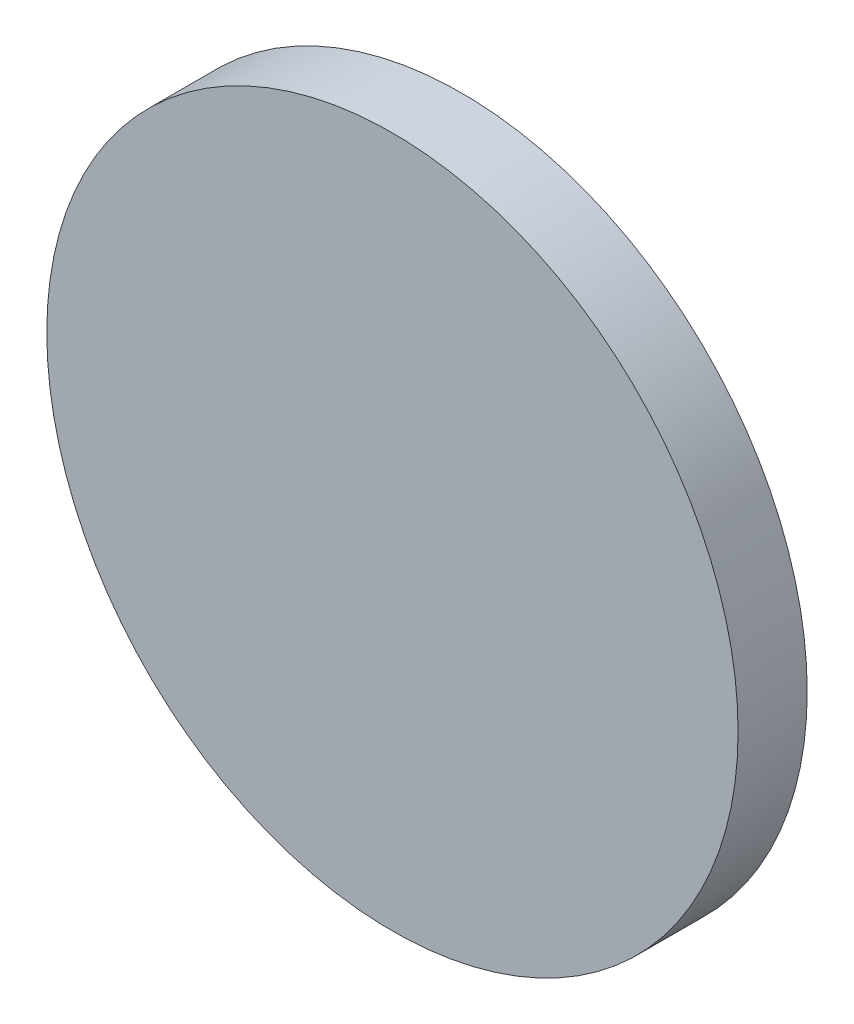
ISO-10303-21;
HEADER;
FILE_DESCRIPTION(('STEP AP214'),'2;1');
FILE_NAME('part.step','',(''),(''),'','','');
FILE_SCHEMA(('AUTOMOTIVE_DESIGN { 1 0 10303 214 1 1 1 1 }'));
ENDSEC;
DATA;
#1=APPLICATION_CONTEXT('core data for automotive mechanical design processes');
#2=APPLICATION_PROTOCOL_DEFINITION('international standard','automotive_design',2000,#1);
#3=PRODUCT_CONTEXT('',#1,'mechanical');
#4=PRODUCT('Part','Part','',(#3));
#5=PRODUCT_RELATED_PRODUCT_CATEGORY('part','',(#4));
#6=PRODUCT_DEFINITION_FORMATION('','',#4);
#7=PRODUCT_DEFINITION_CONTEXT('part definition',#1,'design');
#8=PRODUCT_DEFINITION('design','',#6,#7);
#9=PRODUCT_DEFINITION_SHAPE('','',#8);
#10=(LENGTH_UNIT() NAMED_UNIT(*) SI_UNIT(.MILLI.,.METRE.));
#11=(NAMED_UNIT(*) PLANE_ANGLE_UNIT() SI_UNIT($,.RADIAN.));
#12=(NAMED_UNIT(*) SI_UNIT($,.STERADIAN.) SOLID_ANGLE_UNIT());
#13=UNCERTAINTY_MEASURE_WITH_UNIT(LENGTH_MEASURE(1.E-05),#10,'distance_accuracy_value','');
#14=(GEOMETRIC_REPRESENTATION_CONTEXT(3) GLOBAL_UNCERTAINTY_ASSIGNED_CONTEXT((#13)) GLOBAL_UNIT_ASSIGNED_CONTEXT((#10,
#11,#12)) REPRESENTATION_CONTEXT('',''));
#15=CARTESIAN_POINT('',(0.,0.,0.));
#16=DIRECTION('',(0.,0.,1.));
#17=DIRECTION('',(1.,0.,0.));
#18=AXIS2_PLACEMENT_3D('',#15,#16,#17);
#19=CARTESIAN_POINT('',(-85.,68.,3.));
#20=DIRECTION('',(0.,0.,-1.));
#21=DIRECTION('',(-1.,0.,0.));
#22=AXIS2_PLACEMENT_3D('',#19,#20,#21);
#23=CYLINDRICAL_SURFACE('',#22,15.);
#24=CARTESIAN_POINT('',(-85.,68.,3.));
#25=DIRECTION('',(0.,0.,1.));
#26=DIRECTION('',(1.,0.,0.));
#27=AXIS2_PLACEMENT_3D('',#24,#25,#26);
#28=CIRCLE('',#27,15.);
#29=CARTESIAN_POINT('',(-69.9999999999999,68.,3.));
#30=VERTEX_POINT('',#29);
#31=EDGE_CURVE('E10',#30,#30,#28,.T.);
#32=ORIENTED_EDGE('',*,*,#31,.F.);
#33=EDGE_LOOP('',(#32));
#34=FACE_BOUND('',#33,.T.);
#35=CARTESIAN_POINT('',(-85.,68.,0.));
#36=DIRECTION('',(0.,0.,1.));
#37=DIRECTION('',(1.,0.,0.));
#38=AXIS2_PLACEMENT_3D('',#35,#36,#37);
#39=CIRCLE('',#38,15.);
#40=CARTESIAN_POINT('',(-69.9999999999999,68.,0.));
#41=VERTEX_POINT('',#40);
#42=EDGE_CURVE('E34',#41,#41,#39,.T.);
#43=ORIENTED_EDGE('',*,*,#42,.T.);
#44=EDGE_LOOP('',(#43));
#45=FACE_BOUND('',#44,.T.);
#46=ADVANCED_FACE('F31',(#34,#45),#23,.T.);
#47=CARTESIAN_POINT('',(-85.,68.,3.));
#48=DIRECTION('',(0.,0.,1.));
#49=DIRECTION('',(1.,0.,0.));
#50=AXIS2_PLACEMENT_3D('',#47,#48,#49);
#51=PLANE('',#50);
#52=ORIENTED_EDGE('',*,*,#31,.T.);
#53=EDGE_LOOP('',(#52));
#54=FACE_BOUND('',#53,.T.);
#55=ADVANCED_FACE('F46',(#54),#51,.T.);
#56=CARTESIAN_POINT('',(-85.,68.,0.));
#57=DIRECTION('',(0.,0.,1.));
#58=DIRECTION('',(1.,0.,0.));
#59=AXIS2_PLACEMENT_3D('',#56,#57,#58);
#60=PLANE('',#59);
#61=ORIENTED_EDGE('',*,*,#42,.F.);
#62=EDGE_LOOP('',(#61));
#63=FACE_BOUND('',#62,.T.);
#64=ADVANCED_FACE('F44',(#63),#60,.F.);
#65=CLOSED_SHELL('',(#46,#55,#64));
#66=MANIFOLD_SOLID_BREP('B2',#65);
#67=ADVANCED_BREP_SHAPE_REPRESENTATION('',(#18,#66),#14);
#68=SHAPE_DEFINITION_REPRESENTATION(#9,#67);
ENDSEC;
END-ISO-10303-21;
